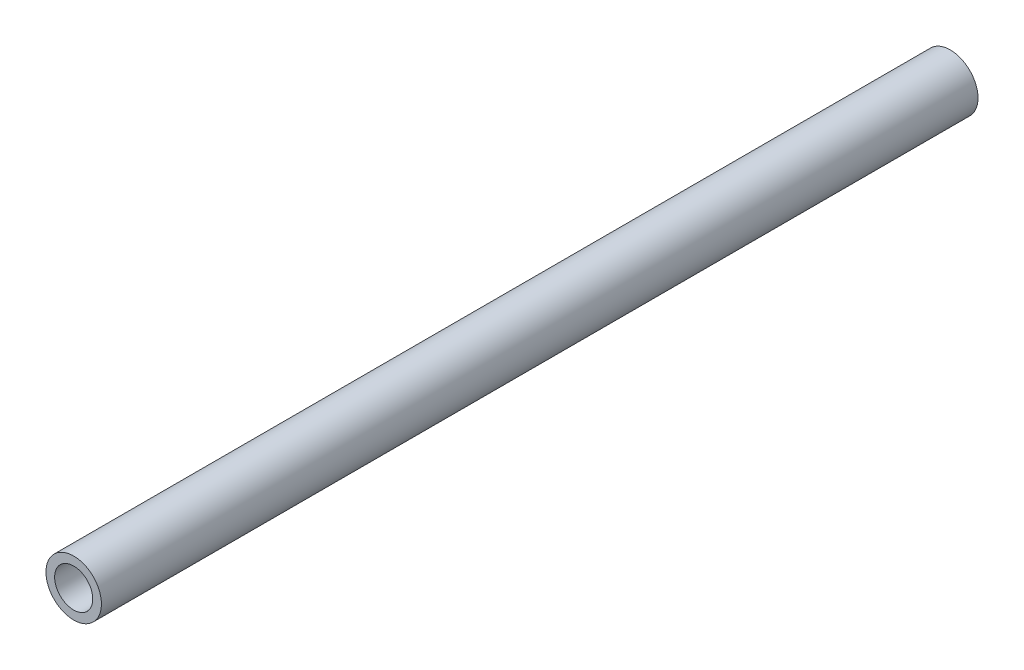
ISO-10303-21;
HEADER;
FILE_DESCRIPTION(('STEP AP214'),'2;1');
FILE_NAME('part.step','',(''),(''),'','','');
FILE_SCHEMA(('AUTOMOTIVE_DESIGN { 1 0 10303 214 1 1 1 1 }'));
ENDSEC;
DATA;
#1=APPLICATION_CONTEXT('core data for automotive mechanical design processes');
#2=APPLICATION_PROTOCOL_DEFINITION('international standard','automotive_design',2000,#1);
#3=PRODUCT_CONTEXT('',#1,'mechanical');
#4=PRODUCT('Part','Part','',(#3));
#5=PRODUCT_RELATED_PRODUCT_CATEGORY('part','',(#4));
#6=PRODUCT_DEFINITION_FORMATION('','',#4);
#7=PRODUCT_DEFINITION_CONTEXT('part definition',#1,'design');
#8=PRODUCT_DEFINITION('design','',#6,#7);
#9=PRODUCT_DEFINITION_SHAPE('','',#8);
#10=(LENGTH_UNIT() NAMED_UNIT(*) SI_UNIT(.MILLI.,.METRE.));
#11=(NAMED_UNIT(*) PLANE_ANGLE_UNIT() SI_UNIT($,.RADIAN.));
#12=(NAMED_UNIT(*) SI_UNIT($,.STERADIAN.) SOLID_ANGLE_UNIT());
#13=UNCERTAINTY_MEASURE_WITH_UNIT(LENGTH_MEASURE(1.E-05),#10,'distance_accuracy_value','');
#14=(GEOMETRIC_REPRESENTATION_CONTEXT(3) GLOBAL_UNCERTAINTY_ASSIGNED_CONTEXT((#13)) GLOBAL_UNIT_ASSIGNED_CONTEXT((#10,
#11,#12)) REPRESENTATION_CONTEXT('',''));
#15=CARTESIAN_POINT('',(0.,0.,0.));
#16=DIRECTION('',(0.,0.,1.));
#17=DIRECTION('',(1.,0.,0.));
#18=AXIS2_PLACEMENT_3D('',#15,#16,#17);
#19=CARTESIAN_POINT('',(0.,0.,-401.32));
#20=DIRECTION('',(0.,0.,1.));
#21=DIRECTION('',(1.,0.,0.));
#22=AXIS2_PLACEMENT_3D('',#19,#20,#21);
#23=CYLINDRICAL_SURFACE('',#22,12.7);
#24=CARTESIAN_POINT('',(0.,0.,-401.32));
#25=DIRECTION('',(0.,0.,1.));
#26=DIRECTION('',(1.,0.,0.));
#27=AXIS2_PLACEMENT_3D('',#24,#25,#26);
#28=CIRCLE('',#27,12.7);
#29=CARTESIAN_POINT('',(12.7,0.,-401.32));
#30=VERTEX_POINT('',#29);
#31=EDGE_CURVE('E12',#30,#30,#28,.T.);
#32=ORIENTED_EDGE('',*,*,#31,.T.);
#33=EDGE_LOOP('',(#32));
#34=FACE_BOUND('',#33,.T.);
#35=CARTESIAN_POINT('',(0.,0.,0.));
#36=DIRECTION('',(0.,0.,1.));
#37=DIRECTION('',(1.,0.,0.));
#38=AXIS2_PLACEMENT_3D('',#35,#36,#37);
#39=CIRCLE('',#38,12.7);
#40=CARTESIAN_POINT('',(12.7,0.,0.));
#41=VERTEX_POINT('',#40);
#42=EDGE_CURVE('E47',#41,#41,#39,.T.);
#43=ORIENTED_EDGE('',*,*,#42,.F.);
#44=EDGE_LOOP('',(#43));
#45=FACE_BOUND('',#44,.T.);
#46=ADVANCED_FACE('F44',(#34,#45),#23,.T.);
#47=CARTESIAN_POINT('',(0.,0.,-401.32));
#48=DIRECTION('',(0.,0.,1.));
#49=DIRECTION('',(1.,0.,0.));
#50=AXIS2_PLACEMENT_3D('',#47,#48,#49);
#51=PLANE('',#50);
#52=CARTESIAN_POINT('',(0.,0.,-401.32));
#53=DIRECTION('',(0.,0.,1.));
#54=DIRECTION('',(1.,0.,0.));
#55=AXIS2_PLACEMENT_3D('',#52,#53,#54);
#56=CIRCLE('',#55,8.73125);
#57=CARTESIAN_POINT('',(8.73125,0.,-401.32));
#58=VERTEX_POINT('',#57);
#59=EDGE_CURVE('E54',#58,#58,#56,.T.);
#60=ORIENTED_EDGE('',*,*,#59,.T.);
#61=EDGE_LOOP('',(#60));
#62=FACE_BOUND('',#61,.T.);
#63=ORIENTED_EDGE('',*,*,#31,.F.);
#64=EDGE_LOOP('',(#63));
#65=FACE_BOUND('',#64,.T.);
#66=ADVANCED_FACE('F62',(#62,#65),#51,.F.);
#67=CARTESIAN_POINT('',(0.,0.,0.));
#68=DIRECTION('',(0.,0.,1.));
#69=DIRECTION('',(1.,0.,0.));
#70=AXIS2_PLACEMENT_3D('',#67,#68,#69);
#71=PLANE('',#70);
#72=CARTESIAN_POINT('',(0.,0.,0.));
#73=DIRECTION('',(0.,0.,1.));
#74=DIRECTION('',(1.,0.,0.));
#75=AXIS2_PLACEMENT_3D('',#72,#73,#74);
#76=CIRCLE('',#75,8.73125);
#77=CARTESIAN_POINT('',(8.73125,0.,0.));
#78=VERTEX_POINT('',#77);
#79=EDGE_CURVE('E56',#78,#78,#76,.T.);
#80=ORIENTED_EDGE('',*,*,#79,.F.);
#81=EDGE_LOOP('',(#80));
#82=FACE_BOUND('',#81,.T.);
#83=ORIENTED_EDGE('',*,*,#42,.T.);
#84=EDGE_LOOP('',(#83));
#85=FACE_BOUND('',#84,.T.);
#86=ADVANCED_FACE('F68',(#82,#85),#71,.T.);
#87=CARTESIAN_POINT('',(0.,0.,-401.32));
#88=DIRECTION('',(0.,0.,1.));
#89=DIRECTION('',(1.,0.,0.));
#90=AXIS2_PLACEMENT_3D('',#87,#88,#89);
#91=CYLINDRICAL_SURFACE('',#90,8.73125);
#92=ORIENTED_EDGE('',*,*,#59,.F.);
#93=EDGE_LOOP('',(#92));
#94=FACE_BOUND('',#93,.T.);
#95=ORIENTED_EDGE('',*,*,#79,.T.);
#96=EDGE_LOOP('',(#95));
#97=FACE_BOUND('',#96,.T.);
#98=ADVANCED_FACE('F65',(#94,#97),#91,.F.);
#99=CLOSED_SHELL('',(#46,#66,#86,#98));
#100=MANIFOLD_SOLID_BREP('B2',#99);
#101=ADVANCED_BREP_SHAPE_REPRESENTATION('',(#18,#100),#14);
#102=SHAPE_DEFINITION_REPRESENTATION(#9,#101);
ENDSEC;
END-ISO-10303-21;
